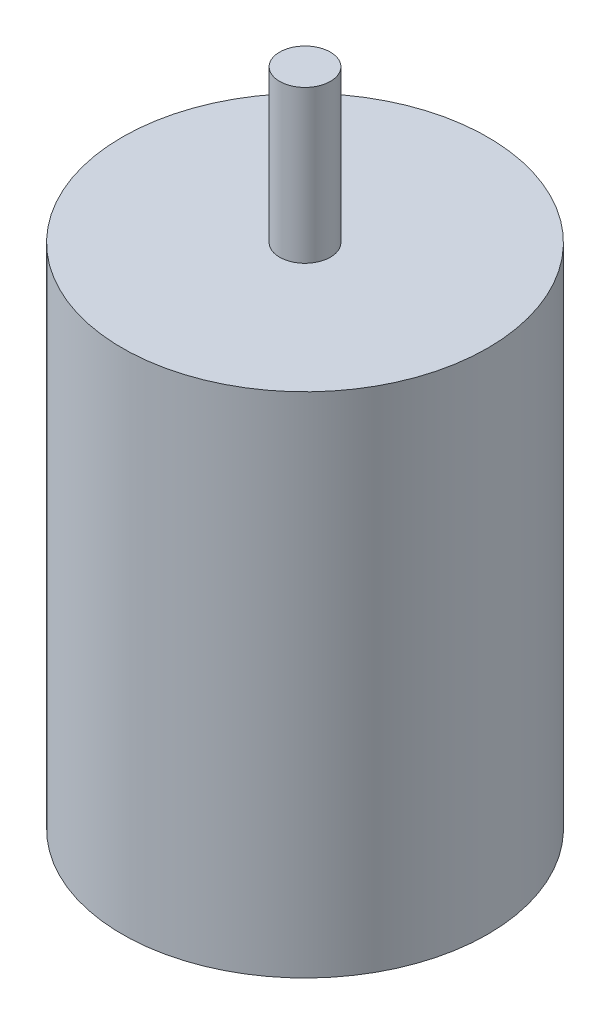
ISO-10303-21;
HEADER;
FILE_DESCRIPTION(('STEP AP214'),'2;1');
FILE_NAME('part.step','',(''),(''),'','','');
FILE_SCHEMA(('AUTOMOTIVE_DESIGN { 1 0 10303 214 1 1 1 1 }'));
ENDSEC;
DATA;
#1=APPLICATION_CONTEXT('core data for automotive mechanical design processes');
#2=APPLICATION_PROTOCOL_DEFINITION('international standard','automotive_design',2000,#1);
#3=PRODUCT_CONTEXT('',#1,'mechanical');
#4=PRODUCT('Part','Part','',(#3));
#5=PRODUCT_RELATED_PRODUCT_CATEGORY('part','',(#4));
#6=PRODUCT_DEFINITION_FORMATION('','',#4);
#7=PRODUCT_DEFINITION_CONTEXT('part definition',#1,'design');
#8=PRODUCT_DEFINITION('design','',#6,#7);
#9=PRODUCT_DEFINITION_SHAPE('','',#8);
#10=(LENGTH_UNIT() NAMED_UNIT(*) SI_UNIT(.MILLI.,.METRE.));
#11=(NAMED_UNIT(*) PLANE_ANGLE_UNIT() SI_UNIT($,.RADIAN.));
#12=(NAMED_UNIT(*) SI_UNIT($,.STERADIAN.) SOLID_ANGLE_UNIT());
#13=UNCERTAINTY_MEASURE_WITH_UNIT(LENGTH_MEASURE(1.E-05),#10,'distance_accuracy_value','');
#14=(GEOMETRIC_REPRESENTATION_CONTEXT(3) GLOBAL_UNCERTAINTY_ASSIGNED_CONTEXT((#13)) GLOBAL_UNIT_ASSIGNED_CONTEXT((#10,
#11,#12)) REPRESENTATION_CONTEXT('',''));
#15=CARTESIAN_POINT('',(0.,0.,0.));
#16=DIRECTION('',(0.,0.,1.));
#17=DIRECTION('',(1.,0.,0.));
#18=AXIS2_PLACEMENT_3D('',#15,#16,#17);
#19=CARTESIAN_POINT('',(0.,25.,0.));
#20=DIRECTION('',(0.,1.,0.));
#21=DIRECTION('',(1.,0.,0.));
#22=AXIS2_PLACEMENT_3D('',#19,#20,#21);
#23=PLANE('',#22);
#24=CARTESIAN_POINT('',(0.,25.,0.));
#25=DIRECTION('',(0.,-1.,0.));
#26=DIRECTION('',(-1.,0.,0.));
#27=AXIS2_PLACEMENT_3D('',#24,#25,#26);
#28=CIRCLE('',#27,2.5);
#29=CARTESIAN_POINT('',(2.5,25.,0.));
#30=VERTEX_POINT('',#29);
#31=EDGE_CURVE('E56',#30,#30,#28,.T.);
#32=ORIENTED_EDGE('',*,*,#31,.T.);
#33=EDGE_LOOP('',(#32));
#34=FACE_BOUND('',#33,.T.);
#35=CARTESIAN_POINT('',(0.,25.,0.));
#36=DIRECTION('',(0.,1.,0.));
#37=DIRECTION('',(1.,0.,0.));
#38=AXIS2_PLACEMENT_3D('',#35,#36,#37);
#39=CIRCLE('',#38,18.);
#40=CARTESIAN_POINT('',(-18.,25.,0.));
#41=VERTEX_POINT('',#40);
#42=EDGE_CURVE('E28',#41,#41,#39,.T.);
#43=ORIENTED_EDGE('',*,*,#42,.T.);
#44=EDGE_LOOP('',(#43));
#45=FACE_BOUND('',#44,.T.);
#46=ADVANCED_FACE('F17',(#34,#45),#23,.T.);
#47=CARTESIAN_POINT('',(0.,0.,0.));
#48=DIRECTION('',(0.,1.,0.));
#49=DIRECTION('',(1.,0.,0.));
#50=AXIS2_PLACEMENT_3D('',#47,#48,#49);
#51=CYLINDRICAL_SURFACE('',#50,18.);
#52=ORIENTED_EDGE('',*,*,#42,.F.);
#53=DIRECTION('',(0.,-1.,0.));
#54=VECTOR('',#53,1.);
#55=CARTESIAN_POINT('',(-18.,0.,0.));
#56=LINE('',#55,#54);
#57=CARTESIAN_POINT('',(-18.,-25.,0.));
#58=VERTEX_POINT('',#57);
#59=EDGE_CURVE('E11',#41,#58,#56,.T.);
#60=ORIENTED_EDGE('',*,*,#59,.T.);
#61=CARTESIAN_POINT('',(0.,-25.,0.));
#62=DIRECTION('',(0.,-1.,0.));
#63=DIRECTION('',(1.,0.,0.));
#64=AXIS2_PLACEMENT_3D('',#61,#62,#63);
#65=CIRCLE('',#64,18.);
#66=EDGE_CURVE('E21',#58,#58,#65,.T.);
#67=ORIENTED_EDGE('',*,*,#66,.F.);
#68=ORIENTED_EDGE('',*,*,#59,.F.);
#69=EDGE_LOOP('',(#52,#60,#67,#68));
#70=FACE_BOUND('',#69,.T.);
#71=ADVANCED_FACE('F19',(#70),#51,.T.);
#72=CARTESIAN_POINT('',(0.,-25.,0.));
#73=DIRECTION('',(0.,1.,0.));
#74=DIRECTION('',(1.,0.,0.));
#75=AXIS2_PLACEMENT_3D('',#72,#73,#74);
#76=PLANE('',#75);
#77=ORIENTED_EDGE('',*,*,#66,.T.);
#78=EDGE_LOOP('',(#77));
#79=FACE_BOUND('',#78,.T.);
#80=ADVANCED_FACE('F72',(#79),#76,.F.);
#81=CARTESIAN_POINT('',(0.,40.,0.));
#82=DIRECTION('',(0.,1.,0.));
#83=DIRECTION('',(1.,0.,0.));
#84=AXIS2_PLACEMENT_3D('',#81,#82,#83);
#85=PLANE('',#84);
#86=CARTESIAN_POINT('',(0.,40.,0.));
#87=DIRECTION('',(0.,1.,0.));
#88=DIRECTION('',(-1.,0.,0.));
#89=AXIS2_PLACEMENT_3D('',#86,#87,#88);
#90=CIRCLE('',#89,2.5);
#91=CARTESIAN_POINT('',(2.5,40.,0.));
#92=VERTEX_POINT('',#91);
#93=EDGE_CURVE('E64',#92,#92,#90,.T.);
#94=ORIENTED_EDGE('',*,*,#93,.T.);
#95=EDGE_LOOP('',(#94));
#96=FACE_BOUND('',#95,.T.);
#97=ADVANCED_FACE('F74',(#96),#85,.T.);
#98=CARTESIAN_POINT('',(0.,25.,0.));
#99=DIRECTION('',(0.,1.,0.));
#100=DIRECTION('',(-1.,0.,0.));
#101=AXIS2_PLACEMENT_3D('',#98,#99,#100);
#102=CYLINDRICAL_SURFACE('',#101,2.5);
#103=ORIENTED_EDGE('',*,*,#93,.F.);
#104=DIRECTION('',(0.,-1.,0.));
#105=VECTOR('',#104,1.);
#106=CARTESIAN_POINT('',(2.5,25.,0.));
#107=LINE('',#106,#105);
#108=EDGE_CURVE('E50',#92,#30,#107,.T.);
#109=ORIENTED_EDGE('',*,*,#108,.T.);
#110=ORIENTED_EDGE('',*,*,#31,.F.);
#111=ORIENTED_EDGE('',*,*,#108,.F.);
#112=EDGE_LOOP('',(#103,#109,#110,#111));
#113=FACE_BOUND('',#112,.T.);
#114=ADVANCED_FACE('F80',(#113),#102,.T.);
#115=CLOSED_SHELL('',(#46,#71,#80,#97,#114));
#116=MANIFOLD_SOLID_BREP('B1',#115);
#117=ADVANCED_BREP_SHAPE_REPRESENTATION('',(#18,#116),#14);
#118=SHAPE_DEFINITION_REPRESENTATION(#9,#117);
ENDSEC;
END-ISO-10303-21;
